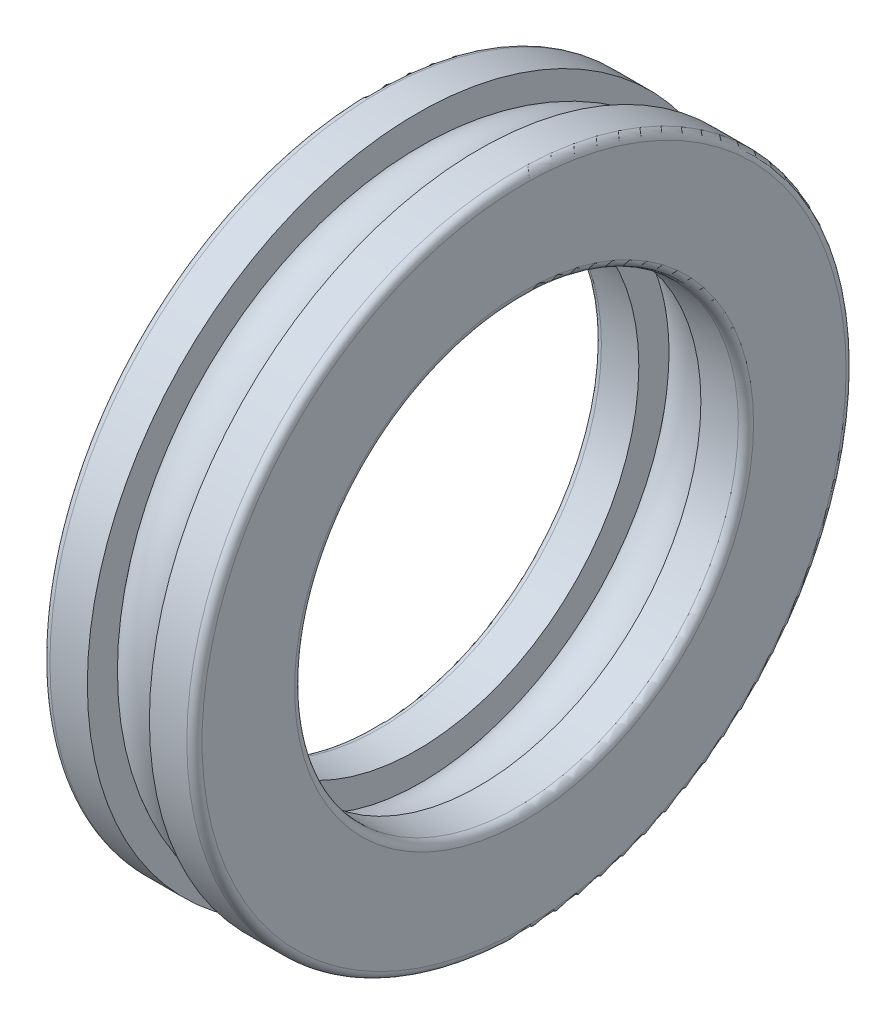
ISO-10303-21;
HEADER;
FILE_DESCRIPTION(('STEP AP214'),'2;1');
FILE_NAME('part.step','',(''),(''),'','','');
FILE_SCHEMA(('AUTOMOTIVE_DESIGN { 1 0 10303 214 1 1 1 1 }'));
ENDSEC;
DATA;
#1=APPLICATION_CONTEXT('core data for automotive mechanical design processes');
#2=APPLICATION_PROTOCOL_DEFINITION('international standard','automotive_design',2000,#1);
#3=PRODUCT_CONTEXT('',#1,'mechanical');
#4=PRODUCT('Part','Part','',(#3));
#5=PRODUCT_RELATED_PRODUCT_CATEGORY('part','',(#4));
#6=PRODUCT_DEFINITION_FORMATION('','',#4);
#7=PRODUCT_DEFINITION_CONTEXT('part definition',#1,'design');
#8=PRODUCT_DEFINITION('design','',#6,#7);
#9=PRODUCT_DEFINITION_SHAPE('','',#8);
#10=(LENGTH_UNIT() NAMED_UNIT(*) SI_UNIT(.MILLI.,.METRE.));
#11=(NAMED_UNIT(*) PLANE_ANGLE_UNIT() SI_UNIT($,.RADIAN.));
#12=(NAMED_UNIT(*) SI_UNIT($,.STERADIAN.) SOLID_ANGLE_UNIT());
#13=UNCERTAINTY_MEASURE_WITH_UNIT(LENGTH_MEASURE(1.E-05),#10,'distance_accuracy_value','');
#14=(GEOMETRIC_REPRESENTATION_CONTEXT(3) GLOBAL_UNCERTAINTY_ASSIGNED_CONTEXT((#13)) GLOBAL_UNIT_ASSIGNED_CONTEXT((#10,
#11,#12)) REPRESENTATION_CONTEXT('',''));
#15=CARTESIAN_POINT('',(0.,0.,0.));
#16=DIRECTION('',(0.,0.,1.));
#17=DIRECTION('',(1.,0.,0.));
#18=AXIS2_PLACEMENT_3D('',#15,#16,#17);
#19=CARTESIAN_POINT('',(0.,0.,0.));
#20=DIRECTION('',(-1.,0.,0.));
#21=DIRECTION('',(0.,0.,1.));
#22=AXIS2_PLACEMENT_3D('',#19,#20,#21);
#23=TOROIDAL_SURFACE('',#22,21.75,3.06);
#24=CARTESIAN_POINT('',(2.448,0.,0.));
#25=DIRECTION('',(-1.,0.,0.));
#26=DIRECTION('',(0.,0.,1.));
#27=AXIS2_PLACEMENT_3D('',#24,#25,#26);
#28=CIRCLE('',#27,23.586);
#29=CARTESIAN_POINT('',(2.448,0.,23.586));
#30=VERTEX_POINT('',#29);
#31=EDGE_CURVE('E32',#30,#30,#28,.T.);
#32=ORIENTED_EDGE('',*,*,#31,.T.);
#33=EDGE_LOOP('',(#32));
#34=FACE_BOUND('',#33,.T.);
#35=CARTESIAN_POINT('',(-2.448,0.,0.));
#36=DIRECTION('',(1.,0.,0.));
#37=DIRECTION('',(0.,0.,-1.));
#38=AXIS2_PLACEMENT_3D('',#35,#36,#37);
#39=CIRCLE('',#38,23.586);
#40=CARTESIAN_POINT('',(-2.448,0.,-23.586));
#41=VERTEX_POINT('',#40);
#42=EDGE_CURVE('E47',#41,#41,#39,.F.);
#43=ORIENTED_EDGE('',*,*,#42,.F.);
#44=EDGE_LOOP('',(#43));
#45=FACE_BOUND('',#44,.T.);
#46=ADVANCED_FACE('F28',(#34,#45),#23,.T.);
#47=CARTESIAN_POINT('',(-2.448,26.,0.));
#48=DIRECTION('',(1.,0.,0.));
#49=DIRECTION('',(0.,0.,-1.));
#50=AXIS2_PLACEMENT_3D('',#47,#48,#49);
#51=PLANE('',#50);
#52=CARTESIAN_POINT('',(-2.448,0.,0.));
#53=DIRECTION('',(1.,0.,0.));
#54=DIRECTION('',(0.,0.,-1.));
#55=AXIS2_PLACEMENT_3D('',#52,#53,#54);
#56=CIRCLE('',#55,26.);
#57=CARTESIAN_POINT('',(-2.448,0.,-26.));
#58=VERTEX_POINT('',#57);
#59=EDGE_CURVE('E10',#58,#58,#56,.T.);
#60=ORIENTED_EDGE('',*,*,#59,.T.);
#61=EDGE_LOOP('',(#60));
#62=FACE_BOUND('',#61,.T.);
#63=ORIENTED_EDGE('',*,*,#42,.T.);
#64=EDGE_LOOP('',(#63));
#65=FACE_BOUND('',#64,.T.);
#66=ADVANCED_FACE('F30',(#62,#65),#51,.T.);
#67=CARTESIAN_POINT('',(-2.448,19.9559763100784,0.));
#68=DIRECTION('',(1.,0.,0.));
#69=DIRECTION('',(0.,0.,-1.));
#70=AXIS2_PLACEMENT_3D('',#67,#68,#69);
#71=PLANE('',#70);
#72=CARTESIAN_POINT('',(-2.44799999999999,0.,0.));
#73=DIRECTION('',(1.,0.,0.));
#74=DIRECTION('',(0.,0.,-1.));
#75=AXIS2_PLACEMENT_3D('',#72,#73,#74);
#76=CIRCLE('',#75,17.5);
#77=CARTESIAN_POINT('',(-2.44799999999999,0.,-17.5));
#78=VERTEX_POINT('',#77);
#79=EDGE_CURVE('E66',#78,#78,#76,.T.);
#80=ORIENTED_EDGE('',*,*,#79,.F.);
#81=EDGE_LOOP('',(#80));
#82=FACE_BOUND('',#81,.T.);
#83=CARTESIAN_POINT('',(-2.448,0.,0.));
#84=DIRECTION('',(-1.,0.,0.));
#85=DIRECTION('',(0.,0.,1.));
#86=AXIS2_PLACEMENT_3D('',#83,#84,#85);
#87=CIRCLE('',#86,19.914);
#88=CARTESIAN_POINT('',(-2.448,0.,19.914));
#89=VERTEX_POINT('',#88);
#90=EDGE_CURVE('E45',#89,#89,#87,.F.);
#91=ORIENTED_EDGE('',*,*,#90,.T.);
#92=EDGE_LOOP('',(#91));
#93=FACE_BOUND('',#92,.T.);
#94=ADVANCED_FACE('F101',(#82,#93),#71,.T.);
#95=CARTESIAN_POINT('',(-34.925,0.,0.));
#96=DIRECTION('',(1.,0.,0.));
#97=DIRECTION('',(0.,0.,-1.));
#98=AXIS2_PLACEMENT_3D('',#95,#96,#97);
#99=CYLINDRICAL_SURFACE('',#98,26.);
#100=CARTESIAN_POINT('',(-5.4,0.,0.));
#101=DIRECTION('',(1.,0.,0.));
#102=DIRECTION('',(0.,0.,-1.));
#103=AXIS2_PLACEMENT_3D('',#100,#101,#102);
#104=CIRCLE('',#103,26.);
#105=CARTESIAN_POINT('',(-5.4,0.,-26.));
#106=VERTEX_POINT('',#105);
#107=EDGE_CURVE('E36',#106,#106,#104,.T.);
#108=ORIENTED_EDGE('',*,*,#107,.T.);
#109=EDGE_LOOP('',(#108));
#110=FACE_BOUND('',#109,.T.);
#111=ORIENTED_EDGE('',*,*,#59,.F.);
#112=EDGE_LOOP('',(#111));
#113=FACE_BOUND('',#112,.T.);
#114=ADVANCED_FACE('F92',(#110,#113),#99,.T.);
#115=CARTESIAN_POINT('',(-5.4,0.,0.));
#116=DIRECTION('',(1.,0.,0.));
#117=DIRECTION('',(0.,0.,-1.));
#118=AXIS2_PLACEMENT_3D('',#115,#116,#117);
#119=TOROIDAL_SURFACE('',#118,25.4,0.599999999999998);
#120=CARTESIAN_POINT('',(-6.,0.,0.));
#121=DIRECTION('',(1.,0.,0.));
#122=DIRECTION('',(0.,0.,-1.));
#123=AXIS2_PLACEMENT_3D('',#120,#121,#122);
#124=CIRCLE('',#123,25.4);
#125=CARTESIAN_POINT('',(-6.,0.,-25.4));
#126=VERTEX_POINT('',#125);
#127=EDGE_CURVE('E41',#126,#126,#124,.T.);
#128=ORIENTED_EDGE('',*,*,#127,.T.);
#129=EDGE_LOOP('',(#128));
#130=FACE_BOUND('',#129,.T.);
#131=ORIENTED_EDGE('',*,*,#107,.F.);
#132=EDGE_LOOP('',(#131));
#133=FACE_BOUND('',#132,.T.);
#134=ADVANCED_FACE('F77',(#130,#133),#119,.T.);
#135=CARTESIAN_POINT('',(-6.,18.1,0.));
#136=DIRECTION('',(-1.,0.,0.));
#137=DIRECTION('',(0.,0.,1.));
#138=AXIS2_PLACEMENT_3D('',#135,#136,#137);
#139=PLANE('',#138);
#140=CARTESIAN_POINT('',(-6.,0.,0.));
#141=DIRECTION('',(1.,0.,0.));
#142=DIRECTION('',(0.,0.,-1.));
#143=AXIS2_PLACEMENT_3D('',#140,#141,#142);
#144=CIRCLE('',#143,18.1);
#145=CARTESIAN_POINT('',(-6.,0.,-18.1));
#146=VERTEX_POINT('',#145);
#147=EDGE_CURVE('E72',#146,#146,#144,.T.);
#148=ORIENTED_EDGE('',*,*,#147,.T.);
#149=EDGE_LOOP('',(#148));
#150=FACE_BOUND('',#149,.T.);
#151=ORIENTED_EDGE('',*,*,#127,.F.);
#152=EDGE_LOOP('',(#151));
#153=FACE_BOUND('',#152,.T.);
#154=ADVANCED_FACE('F80',(#150,#153),#139,.T.);
#155=CARTESIAN_POINT('',(-5.4,0.,0.));
#156=DIRECTION('',(1.,0.,0.));
#157=DIRECTION('',(0.,0.,-1.));
#158=AXIS2_PLACEMENT_3D('',#155,#156,#157);
#159=TOROIDAL_SURFACE('',#158,18.1,0.6);
#160=CARTESIAN_POINT('',(-5.4,0.,0.));
#161=DIRECTION('',(1.,0.,0.));
#162=DIRECTION('',(0.,0.,-1.));
#163=AXIS2_PLACEMENT_3D('',#160,#161,#162);
#164=CIRCLE('',#163,17.5);
#165=CARTESIAN_POINT('',(-5.4,0.,-17.5));
#166=VERTEX_POINT('',#165);
#167=EDGE_CURVE('E69',#166,#166,#164,.T.);
#168=ORIENTED_EDGE('',*,*,#167,.T.);
#169=EDGE_LOOP('',(#168));
#170=FACE_BOUND('',#169,.T.);
#171=ORIENTED_EDGE('',*,*,#147,.F.);
#172=EDGE_LOOP('',(#171));
#173=FACE_BOUND('',#172,.T.);
#174=ADVANCED_FACE('F82',(#170,#173),#159,.T.);
#175=CARTESIAN_POINT('',(-34.925,0.,0.));
#176=DIRECTION('',(1.,0.,0.));
#177=DIRECTION('',(0.,0.,-1.));
#178=AXIS2_PLACEMENT_3D('',#175,#176,#177);
#179=CYLINDRICAL_SURFACE('',#178,17.5);
#180=ORIENTED_EDGE('',*,*,#79,.T.);
#181=EDGE_LOOP('',(#180));
#182=FACE_BOUND('',#181,.T.);
#183=ORIENTED_EDGE('',*,*,#167,.F.);
#184=EDGE_LOOP('',(#183));
#185=FACE_BOUND('',#184,.T.);
#186=ADVANCED_FACE('F89',(#182,#185),#179,.F.);
#187=CARTESIAN_POINT('',(2.448,0.,0.));
#188=DIRECTION('',(1.,0.,0.));
#189=DIRECTION('',(0.,0.,-1.));
#190=AXIS2_PLACEMENT_3D('',#187,#188,#189);
#191=CIRCLE('',#190,19.914);
#192=CARTESIAN_POINT('',(2.448,0.,-19.914));
#193=VERTEX_POINT('',#192);
#194=EDGE_CURVE('E48',#193,#193,#191,.T.);
#195=ORIENTED_EDGE('',*,*,#194,.T.);
#196=EDGE_LOOP('',(#195));
#197=FACE_BOUND('',#196,.T.);
#198=ORIENTED_EDGE('',*,*,#90,.F.);
#199=EDGE_LOOP('',(#198));
#200=FACE_BOUND('',#199,.T.);
#201=ADVANCED_FACE('F97',(#197,#200),#23,.T.);
#202=CARTESIAN_POINT('',(2.448,26.,0.));
#203=DIRECTION('',(-1.,0.,0.));
#204=DIRECTION('',(0.,0.,-1.));
#205=AXIS2_PLACEMENT_3D('',#202,#203,#204);
#206=PLANE('',#205);
#207=CARTESIAN_POINT('',(2.448,0.,0.));
#208=DIRECTION('',(1.,0.,0.));
#209=DIRECTION('',(0.,0.,-1.));
#210=AXIS2_PLACEMENT_3D('',#207,#208,#209);
#211=CIRCLE('',#210,26.);
#212=CARTESIAN_POINT('',(2.448,0.,-26.));
#213=VERTEX_POINT('',#212);
#214=EDGE_CURVE('E50',#213,#213,#211,.T.);
#215=ORIENTED_EDGE('',*,*,#214,.F.);
#216=EDGE_LOOP('',(#215));
#217=FACE_BOUND('',#216,.T.);
#218=ORIENTED_EDGE('',*,*,#31,.F.);
#219=EDGE_LOOP('',(#218));
#220=FACE_BOUND('',#219,.T.);
#221=ADVANCED_FACE('F106',(#217,#220),#206,.T.);
#222=CARTESIAN_POINT('',(2.448,19.9559763100784,0.));
#223=DIRECTION('',(-1.,0.,0.));
#224=DIRECTION('',(0.,0.,-1.));
#225=AXIS2_PLACEMENT_3D('',#222,#223,#224);
#226=PLANE('',#225);
#227=CARTESIAN_POINT('',(2.44799999999999,0.,0.));
#228=DIRECTION('',(1.,0.,0.));
#229=DIRECTION('',(0.,0.,-1.));
#230=AXIS2_PLACEMENT_3D('',#227,#228,#229);
#231=CIRCLE('',#230,17.5);
#232=CARTESIAN_POINT('',(2.44799999999999,0.,-17.5));
#233=VERTEX_POINT('',#232);
#234=EDGE_CURVE('E243',#233,#233,#231,.T.);
#235=ORIENTED_EDGE('',*,*,#234,.T.);
#236=EDGE_LOOP('',(#235));
#237=FACE_BOUND('',#236,.T.);
#238=ORIENTED_EDGE('',*,*,#194,.F.);
#239=EDGE_LOOP('',(#238));
#240=FACE_BOUND('',#239,.T.);
#241=ADVANCED_FACE('F111',(#237,#240),#226,.T.);
#242=CARTESIAN_POINT('',(34.925,0.,0.));
#243=DIRECTION('',(-1.,0.,0.));
#244=DIRECTION('',(0.,0.,-1.));
#245=AXIS2_PLACEMENT_3D('',#242,#243,#244);
#246=CYLINDRICAL_SURFACE('',#245,26.);
#247=CARTESIAN_POINT('',(5.4,0.,0.));
#248=DIRECTION('',(1.,0.,0.));
#249=DIRECTION('',(0.,0.,-1.));
#250=AXIS2_PLACEMENT_3D('',#247,#248,#249);
#251=CIRCLE('',#250,26.);
#252=CARTESIAN_POINT('',(5.4,0.,-26.));
#253=VERTEX_POINT('',#252);
#254=EDGE_CURVE('E55',#253,#253,#251,.T.);
#255=ORIENTED_EDGE('',*,*,#254,.F.);
#256=EDGE_LOOP('',(#255));
#257=FACE_BOUND('',#256,.T.);
#258=ORIENTED_EDGE('',*,*,#214,.T.);
#259=EDGE_LOOP('',(#258));
#260=FACE_BOUND('',#259,.T.);
#261=ADVANCED_FACE('F186',(#257,#260),#246,.T.);
#262=CARTESIAN_POINT('',(5.4,0.,0.));
#263=DIRECTION('',(-1.,0.,0.));
#264=DIRECTION('',(0.,0.,-1.));
#265=AXIS2_PLACEMENT_3D('',#262,#263,#264);
#266=TOROIDAL_SURFACE('',#265,25.4,0.599999999999998);
#267=CARTESIAN_POINT('',(6.,0.,0.));
#268=DIRECTION('',(1.,0.,0.));
#269=DIRECTION('',(0.,0.,-1.));
#270=AXIS2_PLACEMENT_3D('',#267,#268,#269);
#271=CIRCLE('',#270,25.4);
#272=CARTESIAN_POINT('',(6.,0.,-25.4));
#273=VERTEX_POINT('',#272);
#274=EDGE_CURVE('E60',#273,#273,#271,.T.);
#275=ORIENTED_EDGE('',*,*,#274,.F.);
#276=EDGE_LOOP('',(#275));
#277=FACE_BOUND('',#276,.T.);
#278=ORIENTED_EDGE('',*,*,#254,.T.);
#279=EDGE_LOOP('',(#278));
#280=FACE_BOUND('',#279,.T.);
#281=ADVANCED_FACE('F196',(#277,#280),#266,.T.);
#282=CARTESIAN_POINT('',(6.,18.1,0.));
#283=DIRECTION('',(1.,0.,0.));
#284=DIRECTION('',(0.,0.,1.));
#285=AXIS2_PLACEMENT_3D('',#282,#283,#284);
#286=PLANE('',#285);
#287=CARTESIAN_POINT('',(6.,0.,0.));
#288=DIRECTION('',(1.,0.,0.));
#289=DIRECTION('',(0.,0.,-1.));
#290=AXIS2_PLACEMENT_3D('',#287,#288,#289);
#291=CIRCLE('',#290,18.1);
#292=CARTESIAN_POINT('',(6.,0.,-18.1));
#293=VERTEX_POINT('',#292);
#294=EDGE_CURVE('E247',#293,#293,#291,.T.);
#295=ORIENTED_EDGE('',*,*,#294,.F.);
#296=EDGE_LOOP('',(#295));
#297=FACE_BOUND('',#296,.T.);
#298=ORIENTED_EDGE('',*,*,#274,.T.);
#299=EDGE_LOOP('',(#298));
#300=FACE_BOUND('',#299,.T.);
#301=ADVANCED_FACE('F206',(#297,#300),#286,.T.);
#302=CARTESIAN_POINT('',(5.4,0.,0.));
#303=DIRECTION('',(-1.,0.,0.));
#304=DIRECTION('',(0.,0.,-1.));
#305=AXIS2_PLACEMENT_3D('',#302,#303,#304);
#306=TOROIDAL_SURFACE('',#305,18.1,0.6);
#307=CARTESIAN_POINT('',(5.4,0.,0.));
#308=DIRECTION('',(1.,0.,0.));
#309=DIRECTION('',(0.,0.,-1.));
#310=AXIS2_PLACEMENT_3D('',#307,#308,#309);
#311=CIRCLE('',#310,17.5);
#312=CARTESIAN_POINT('',(5.4,0.,-17.5));
#313=VERTEX_POINT('',#312);
#314=EDGE_CURVE('E246',#313,#313,#311,.T.);
#315=ORIENTED_EDGE('',*,*,#314,.F.);
#316=EDGE_LOOP('',(#315));
#317=FACE_BOUND('',#316,.T.);
#318=ORIENTED_EDGE('',*,*,#294,.T.);
#319=EDGE_LOOP('',(#318));
#320=FACE_BOUND('',#319,.T.);
#321=ADVANCED_FACE('F216',(#317,#320),#306,.T.);
#322=CARTESIAN_POINT('',(34.925,0.,0.));
#323=DIRECTION('',(-1.,0.,0.));
#324=DIRECTION('',(0.,0.,-1.));
#325=AXIS2_PLACEMENT_3D('',#322,#323,#324);
#326=CYLINDRICAL_SURFACE('',#325,17.5);
#327=ORIENTED_EDGE('',*,*,#234,.F.);
#328=EDGE_LOOP('',(#327));
#329=FACE_BOUND('',#328,.T.);
#330=ORIENTED_EDGE('',*,*,#314,.T.);
#331=EDGE_LOOP('',(#330));
#332=FACE_BOUND('',#331,.T.);
#333=ADVANCED_FACE('F226',(#329,#332),#326,.F.);
#334=CLOSED_SHELL('',(#46,#66,#94,#114,#134,#154,#174,#186,#201,#221,#241,#261,#281,#301,#321,#333));
#335=MANIFOLD_SOLID_BREP('B2',#334);
#336=ADVANCED_BREP_SHAPE_REPRESENTATION('',(#18,#335),#14);
#337=SHAPE_DEFINITION_REPRESENTATION(#9,#336);
ENDSEC;
END-ISO-10303-21;
